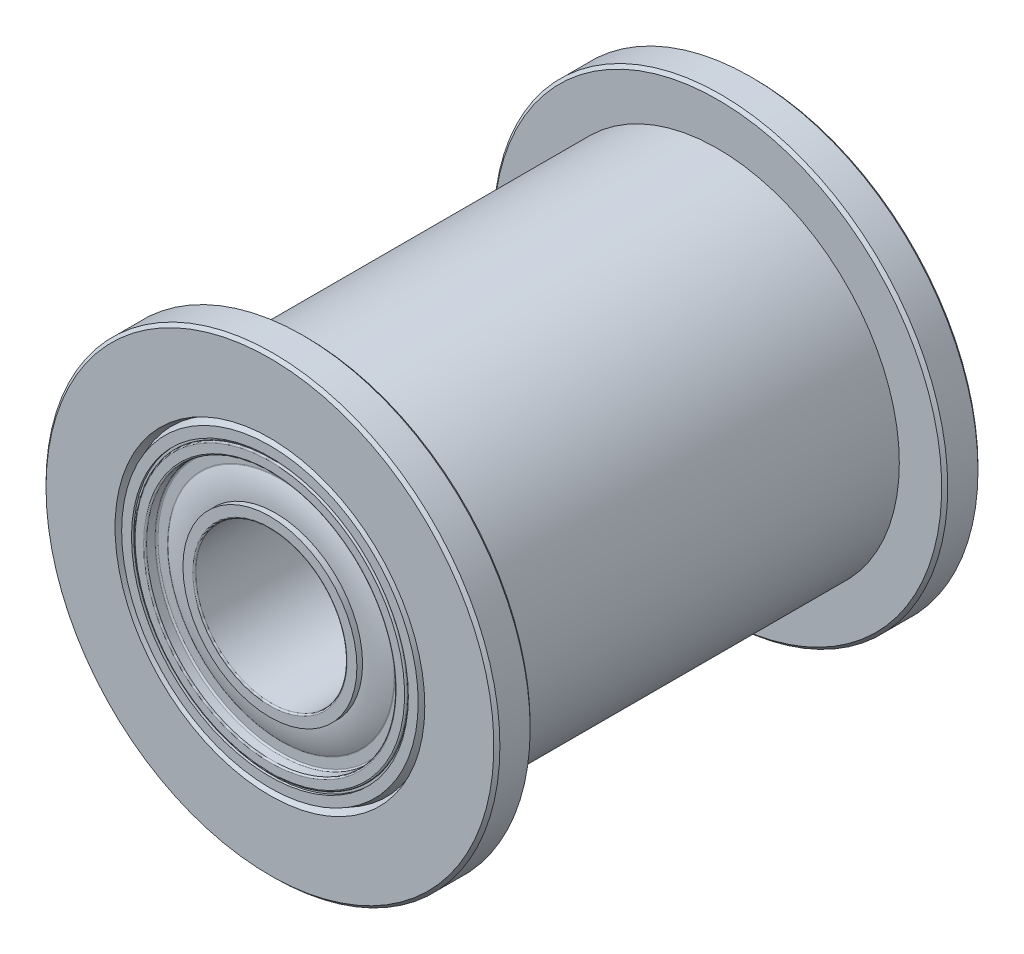
ISO-10303-21;
HEADER;
FILE_DESCRIPTION(('STEP AP214'),'2;1');
FILE_NAME('part.step','',(''),(''),'','','');
FILE_SCHEMA(('AUTOMOTIVE_DESIGN { 1 0 10303 214 1 1 1 1 }'));
ENDSEC;
DATA;
#1=APPLICATION_CONTEXT('core data for automotive mechanical design processes');
#2=APPLICATION_PROTOCOL_DEFINITION('international standard','automotive_design',2000,#1);
#3=PRODUCT_CONTEXT('',#1,'mechanical');
#4=PRODUCT('Part','Part','',(#3));
#5=PRODUCT_RELATED_PRODUCT_CATEGORY('part','',(#4));
#6=PRODUCT_DEFINITION_FORMATION('','',#4);
#7=PRODUCT_DEFINITION_CONTEXT('part definition',#1,'design');
#8=PRODUCT_DEFINITION('design','',#6,#7);
#9=PRODUCT_DEFINITION_SHAPE('','',#8);
#10=(LENGTH_UNIT() NAMED_UNIT(*) SI_UNIT(.MILLI.,.METRE.));
#11=(NAMED_UNIT(*) PLANE_ANGLE_UNIT() SI_UNIT($,.RADIAN.));
#12=(NAMED_UNIT(*) SI_UNIT($,.STERADIAN.) SOLID_ANGLE_UNIT());
#13=UNCERTAINTY_MEASURE_WITH_UNIT(LENGTH_MEASURE(1.E-05),#10,'distance_accuracy_value','');
#14=(GEOMETRIC_REPRESENTATION_CONTEXT(3) GLOBAL_UNCERTAINTY_ASSIGNED_CONTEXT((#13)) GLOBAL_UNIT_ASSIGNED_CONTEXT((#10,
#11,#12)) REPRESENTATION_CONTEXT('',''));
#15=CARTESIAN_POINT('',(0.,0.,0.));
#16=DIRECTION('',(0.,0.,1.));
#17=DIRECTION('',(1.,0.,0.));
#18=AXIS2_PLACEMENT_3D('',#15,#16,#17);
#19=CARTESIAN_POINT('',(0.,7.5,-6.8));
#20=DIRECTION('',(0.,0.,-1.));
#21=DIRECTION('',(-1.,0.,0.));
#22=AXIS2_PLACEMENT_3D('',#19,#20,#21);
#23=PLANE('',#22);
#24=CARTESIAN_POINT('',(0.,0.,-6.8));
#25=DIRECTION('',(0.,0.,-1.));
#26=DIRECTION('',(-1.,0.,0.));
#27=AXIS2_PLACEMENT_3D('',#24,#25,#26);
#28=CIRCLE('',#27,7.39999999999999);
#29=CARTESIAN_POINT('',(-7.39999999999999,0.,-6.8));
#30=VERTEX_POINT('',#29);
#31=EDGE_CURVE('E54',#30,#30,#28,.F.);
#32=ORIENTED_EDGE('',*,*,#31,.T.);
#33=EDGE_LOOP('',(#32));
#34=FACE_BOUND('',#33,.T.);
#35=CARTESIAN_POINT('',(0.,0.,-6.8));
#36=DIRECTION('',(0.,0.,1.));
#37=DIRECTION('',(1.,0.,0.));
#38=AXIS2_PLACEMENT_3D('',#35,#36,#37);
#39=CIRCLE('',#38,6.);
#40=CARTESIAN_POINT('',(6.,0.,-6.8));
#41=VERTEX_POINT('',#40);
#42=EDGE_CURVE('E85',#41,#41,#39,.T.);
#43=ORIENTED_EDGE('',*,*,#42,.F.);
#44=EDGE_LOOP('',(#43));
#45=FACE_BOUND('',#44,.T.);
#46=ADVANCED_FACE('F34',(#34,#45),#23,.F.);
#47=CARTESIAN_POINT('',(0.,0.,8.));
#48=DIRECTION('',(0.,0.,1.));
#49=DIRECTION('',(1.,0.,0.));
#50=AXIS2_PLACEMENT_3D('',#47,#48,#49);
#51=CYLINDRICAL_SURFACE('',#50,7.5);
#52=CARTESIAN_POINT('',(0.,0.,-7.9));
#53=DIRECTION('',(0.,0.,1.));
#54=DIRECTION('',(1.,0.,0.));
#55=AXIS2_PLACEMENT_3D('',#52,#53,#54);
#56=CIRCLE('',#55,7.5);
#57=CARTESIAN_POINT('',(7.5,0.,-7.9));
#58=VERTEX_POINT('',#57);
#59=EDGE_CURVE('E60',#58,#58,#56,.T.);
#60=ORIENTED_EDGE('',*,*,#59,.T.);
#61=EDGE_LOOP('',(#60));
#62=FACE_BOUND('',#61,.T.);
#63=CARTESIAN_POINT('',(0.,0.,-6.90000000000001));
#64=DIRECTION('',(0.,0.,-1.));
#65=DIRECTION('',(-1.,0.,0.));
#66=AXIS2_PLACEMENT_3D('',#63,#64,#65);
#67=CIRCLE('',#66,7.5);
#68=CARTESIAN_POINT('',(-7.5,0.,-6.90000000000001));
#69=VERTEX_POINT('',#68);
#70=EDGE_CURVE('E63',#69,#69,#67,.T.);
#71=ORIENTED_EDGE('',*,*,#70,.T.);
#72=EDGE_LOOP('',(#71));
#73=FACE_BOUND('',#72,.T.);
#74=ADVANCED_FACE('F200',(#62,#73),#51,.T.);
#75=CARTESIAN_POINT('',(0.,7.5,-8.));
#76=DIRECTION('',(0.,0.,1.));
#77=DIRECTION('',(1.,0.,0.));
#78=AXIS2_PLACEMENT_3D('',#75,#76,#77);
#79=PLANE('',#78);
#80=CARTESIAN_POINT('',(0.,0.,-8.));
#81=DIRECTION('',(0.,0.,1.));
#82=DIRECTION('',(1.,0.,0.));
#83=AXIS2_PLACEMENT_3D('',#80,#81,#82);
#84=CIRCLE('',#83,7.40000000000001);
#85=CARTESIAN_POINT('',(7.40000000000001,0.,-8.));
#86=VERTEX_POINT('',#85);
#87=EDGE_CURVE('E57',#86,#86,#84,.F.);
#88=ORIENTED_EDGE('',*,*,#87,.T.);
#89=EDGE_LOOP('',(#88));
#90=FACE_BOUND('',#89,.T.);
#91=CARTESIAN_POINT('',(0.,0.,-8.));
#92=DIRECTION('',(0.,0.,1.));
#93=DIRECTION('',(1.,0.,0.));
#94=AXIS2_PLACEMENT_3D('',#91,#92,#93);
#95=CIRCLE('',#94,5.11838214055972);
#96=CARTESIAN_POINT('',(5.11838214055972,0.,-8.));
#97=VERTEX_POINT('',#96);
#98=EDGE_CURVE('E66',#97,#97,#95,.T.);
#99=ORIENTED_EDGE('',*,*,#98,.T.);
#100=EDGE_LOOP('',(#99));
#101=FACE_BOUND('',#100,.T.);
#102=ADVANCED_FACE('F206',(#90,#101),#79,.F.);
#103=CARTESIAN_POINT('',(0.,0.,-7.7));
#104=DIRECTION('',(0.,0.,-1.));
#105=DIRECTION('',(-1.,0.,0.));
#106=AXIS2_PLACEMENT_3D('',#103,#104,#105);
#107=CONICAL_SURFACE('',#106,5.00919107027986,0.349065850398862);
#108=ORIENTED_EDGE('',*,*,#98,.F.);
#109=EDGE_LOOP('',(#108));
#110=FACE_BOUND('',#109,.T.);
#111=CARTESIAN_POINT('',(0.,0.,-7.7));
#112=DIRECTION('',(0.,0.,1.));
#113=DIRECTION('',(1.,0.,0.));
#114=AXIS2_PLACEMENT_3D('',#111,#112,#113);
#115=CIRCLE('',#114,5.00919107027986);
#116=CARTESIAN_POINT('',(5.00919107027986,0.,-7.7));
#117=VERTEX_POINT('',#116);
#118=EDGE_CURVE('E69',#117,#117,#115,.T.);
#119=ORIENTED_EDGE('',*,*,#118,.T.);
#120=EDGE_LOOP('',(#119));
#121=FACE_BOUND('',#120,.T.);
#122=ADVANCED_FACE('F282',(#110,#121),#107,.F.);
#123=CARTESIAN_POINT('',(0.,0.,-8.));
#124=DIRECTION('',(0.,0.,1.));
#125=DIRECTION('',(1.,0.,0.));
#126=AXIS2_PLACEMENT_3D('',#123,#124,#125);
#127=CONICAL_SURFACE('',#126,4.9,0.349065850398862);
#128=ORIENTED_EDGE('',*,*,#118,.F.);
#129=EDGE_LOOP('',(#128));
#130=FACE_BOUND('',#129,.T.);
#131=CARTESIAN_POINT('',(0.,0.,-8.));
#132=DIRECTION('',(0.,0.,1.));
#133=DIRECTION('',(1.,0.,0.));
#134=AXIS2_PLACEMENT_3D('',#131,#132,#133);
#135=CIRCLE('',#134,4.9);
#136=CARTESIAN_POINT('',(4.9,0.,-8.));
#137=VERTEX_POINT('',#136);
#138=EDGE_CURVE('E72',#137,#137,#135,.T.);
#139=ORIENTED_EDGE('',*,*,#138,.T.);
#140=EDGE_LOOP('',(#139));
#141=FACE_BOUND('',#140,.T.);
#142=ADVANCED_FACE('F278',(#130,#141),#127,.T.);
#143=CARTESIAN_POINT('',(0.,4.9,-8.));
#144=DIRECTION('',(0.,0.,1.));
#145=DIRECTION('',(1.,0.,0.));
#146=AXIS2_PLACEMENT_3D('',#143,#144,#145);
#147=PLANE('',#146);
#148=ORIENTED_EDGE('',*,*,#138,.F.);
#149=EDGE_LOOP('',(#148));
#150=FACE_BOUND('',#149,.T.);
#151=CARTESIAN_POINT('',(0.,0.,-8.));
#152=DIRECTION('',(0.,0.,1.));
#153=DIRECTION('',(1.,0.,0.));
#154=AXIS2_PLACEMENT_3D('',#151,#152,#153);
#155=CIRCLE('',#154,4.575);
#156=CARTESIAN_POINT('',(4.575,0.,-8.));
#157=VERTEX_POINT('',#156);
#158=EDGE_CURVE('E75',#157,#157,#155,.T.);
#159=ORIENTED_EDGE('',*,*,#158,.T.);
#160=EDGE_LOOP('',(#159));
#161=FACE_BOUND('',#160,.T.);
#162=ADVANCED_FACE('F274',(#150,#161),#147,.F.);
#163=CARTESIAN_POINT('',(0.,0.,8.));
#164=DIRECTION('',(0.,0.,1.));
#165=DIRECTION('',(1.,0.,0.));
#166=AXIS2_PLACEMENT_3D('',#163,#164,#165);
#167=CYLINDRICAL_SURFACE('',#166,4.575);
#168=ORIENTED_EDGE('',*,*,#158,.F.);
#169=EDGE_LOOP('',(#168));
#170=FACE_BOUND('',#169,.T.);
#171=CARTESIAN_POINT('',(0.,0.,-7.925));
#172=DIRECTION('',(0.,0.,1.));
#173=DIRECTION('',(1.,0.,0.));
#174=AXIS2_PLACEMENT_3D('',#171,#172,#173);
#175=CIRCLE('',#174,4.575);
#176=CARTESIAN_POINT('',(4.575,0.,-7.925));
#177=VERTEX_POINT('',#176);
#178=EDGE_CURVE('E78',#177,#177,#175,.T.);
#179=ORIENTED_EDGE('',*,*,#178,.T.);
#180=EDGE_LOOP('',(#179));
#181=FACE_BOUND('',#180,.T.);
#182=ADVANCED_FACE('F270',(#170,#181),#167,.F.);
#183=CARTESIAN_POINT('',(0.,4.5,-7.925));
#184=DIRECTION('',(0.,0.,1.));
#185=DIRECTION('',(1.,0.,0.));
#186=AXIS2_PLACEMENT_3D('',#183,#184,#185);
#187=PLANE('',#186);
#188=ORIENTED_EDGE('',*,*,#178,.F.);
#189=EDGE_LOOP('',(#188));
#190=FACE_BOUND('',#189,.T.);
#191=CARTESIAN_POINT('',(0.,0.,-7.925));
#192=DIRECTION('',(0.,0.,1.));
#193=DIRECTION('',(1.,0.,0.));
#194=AXIS2_PLACEMENT_3D('',#191,#192,#193);
#195=CIRCLE('',#194,4.5);
#196=CARTESIAN_POINT('',(4.5,0.,-7.925));
#197=VERTEX_POINT('',#196);
#198=EDGE_CURVE('E82',#197,#197,#195,.T.);
#199=ORIENTED_EDGE('',*,*,#198,.T.);
#200=EDGE_LOOP('',(#199));
#201=FACE_BOUND('',#200,.T.);
#202=ADVANCED_FACE('F266',(#190,#201),#187,.F.);
#203=CARTESIAN_POINT('',(0.,4.5,7.925));
#204=DIRECTION('',(0.,0.,-1.));
#205=DIRECTION('',(-1.,0.,0.));
#206=AXIS2_PLACEMENT_3D('',#203,#204,#205);
#207=PLANE('',#206);
#208=CARTESIAN_POINT('',(0.,0.,7.925));
#209=DIRECTION('',(0.,0.,1.));
#210=DIRECTION('',(1.,0.,0.));
#211=AXIS2_PLACEMENT_3D('',#208,#209,#210);
#212=CIRCLE('',#211,4.5);
#213=CARTESIAN_POINT('',(4.5,0.,7.925));
#214=VERTEX_POINT('',#213);
#215=EDGE_CURVE('E81',#214,#214,#212,.T.);
#216=ORIENTED_EDGE('',*,*,#215,.F.);
#217=EDGE_LOOP('',(#216));
#218=FACE_BOUND('',#217,.T.);
#219=CARTESIAN_POINT('',(0.,0.,7.925));
#220=DIRECTION('',(0.,0.,1.));
#221=DIRECTION('',(1.,0.,0.));
#222=AXIS2_PLACEMENT_3D('',#219,#220,#221);
#223=CIRCLE('',#222,4.575);
#224=CARTESIAN_POINT('',(4.575,0.,7.925));
#225=VERTEX_POINT('',#224);
#226=EDGE_CURVE('E89',#225,#225,#223,.T.);
#227=ORIENTED_EDGE('',*,*,#226,.T.);
#228=EDGE_LOOP('',(#227));
#229=FACE_BOUND('',#228,.T.);
#230=ADVANCED_FACE('F262',(#218,#229),#207,.F.);
#231=CARTESIAN_POINT('',(0.,0.,8.));
#232=DIRECTION('',(0.,0.,1.));
#233=DIRECTION('',(1.,0.,0.));
#234=AXIS2_PLACEMENT_3D('',#231,#232,#233);
#235=CYLINDRICAL_SURFACE('',#234,4.575);
#236=ORIENTED_EDGE('',*,*,#226,.F.);
#237=EDGE_LOOP('',(#236));
#238=FACE_BOUND('',#237,.T.);
#239=CARTESIAN_POINT('',(0.,0.,8.));
#240=DIRECTION('',(0.,0.,1.));
#241=DIRECTION('',(1.,0.,0.));
#242=AXIS2_PLACEMENT_3D('',#239,#240,#241);
#243=CIRCLE('',#242,4.575);
#244=CARTESIAN_POINT('',(4.575,0.,8.));
#245=VERTEX_POINT('',#244);
#246=EDGE_CURVE('E92',#245,#245,#243,.T.);
#247=ORIENTED_EDGE('',*,*,#246,.T.);
#248=EDGE_LOOP('',(#247));
#249=FACE_BOUND('',#248,.T.);
#250=ADVANCED_FACE('F258',(#238,#249),#235,.F.);
#251=CARTESIAN_POINT('',(0.,4.9,8.));
#252=DIRECTION('',(0.,0.,-1.));
#253=DIRECTION('',(-1.,0.,0.));
#254=AXIS2_PLACEMENT_3D('',#251,#252,#253);
#255=PLANE('',#254);
#256=ORIENTED_EDGE('',*,*,#246,.F.);
#257=EDGE_LOOP('',(#256));
#258=FACE_BOUND('',#257,.T.);
#259=CARTESIAN_POINT('',(0.,0.,8.));
#260=DIRECTION('',(0.,0.,1.));
#261=DIRECTION('',(1.,0.,0.));
#262=AXIS2_PLACEMENT_3D('',#259,#260,#261);
#263=CIRCLE('',#262,4.9);
#264=CARTESIAN_POINT('',(4.9,0.,8.));
#265=VERTEX_POINT('',#264);
#266=EDGE_CURVE('E95',#265,#265,#263,.T.);
#267=ORIENTED_EDGE('',*,*,#266,.T.);
#268=EDGE_LOOP('',(#267));
#269=FACE_BOUND('',#268,.T.);
#270=ADVANCED_FACE('F254',(#258,#269),#255,.F.);
#271=CARTESIAN_POINT('',(0.,0.,7.7));
#272=DIRECTION('',(0.,0.,-1.));
#273=DIRECTION('',(-1.,0.,0.));
#274=AXIS2_PLACEMENT_3D('',#271,#272,#273);
#275=CONICAL_SURFACE('',#274,5.00919107027986,0.349065850398864);
#276=ORIENTED_EDGE('',*,*,#266,.F.);
#277=EDGE_LOOP('',(#276));
#278=FACE_BOUND('',#277,.T.);
#279=CARTESIAN_POINT('',(0.,0.,7.7));
#280=DIRECTION('',(0.,0.,1.));
#281=DIRECTION('',(1.,0.,0.));
#282=AXIS2_PLACEMENT_3D('',#279,#280,#281);
#283=CIRCLE('',#282,5.00919107027986);
#284=CARTESIAN_POINT('',(5.00919107027986,0.,7.7));
#285=VERTEX_POINT('',#284);
#286=EDGE_CURVE('E98',#285,#285,#283,.T.);
#287=ORIENTED_EDGE('',*,*,#286,.T.);
#288=EDGE_LOOP('',(#287));
#289=FACE_BOUND('',#288,.T.);
#290=ADVANCED_FACE('F250',(#278,#289),#275,.T.);
#291=CARTESIAN_POINT('',(0.,0.,8.));
#292=DIRECTION('',(0.,0.,1.));
#293=DIRECTION('',(1.,0.,0.));
#294=AXIS2_PLACEMENT_3D('',#291,#292,#293);
#295=CONICAL_SURFACE('',#294,5.11838214055972,0.349065850398864);
#296=ORIENTED_EDGE('',*,*,#286,.F.);
#297=EDGE_LOOP('',(#296));
#298=FACE_BOUND('',#297,.T.);
#299=CARTESIAN_POINT('',(0.,0.,8.));
#300=DIRECTION('',(0.,0.,1.));
#301=DIRECTION('',(1.,0.,0.));
#302=AXIS2_PLACEMENT_3D('',#299,#300,#301);
#303=CIRCLE('',#302,5.11838214055972);
#304=CARTESIAN_POINT('',(5.11838214055972,0.,8.));
#305=VERTEX_POINT('',#304);
#306=EDGE_CURVE('E101',#305,#305,#303,.T.);
#307=ORIENTED_EDGE('',*,*,#306,.T.);
#308=EDGE_LOOP('',(#307));
#309=FACE_BOUND('',#308,.T.);
#310=ADVANCED_FACE('F244',(#298,#309),#295,.F.);
#311=CARTESIAN_POINT('',(0.,7.5,8.));
#312=DIRECTION('',(0.,0.,-1.));
#313=DIRECTION('',(-1.,0.,0.));
#314=AXIS2_PLACEMENT_3D('',#311,#312,#313);
#315=PLANE('',#314);
#316=CARTESIAN_POINT('',(0.,0.,8.));
#317=DIRECTION('',(0.,0.,-1.));
#318=DIRECTION('',(-1.,0.,0.));
#319=AXIS2_PLACEMENT_3D('',#316,#317,#318);
#320=CIRCLE('',#319,7.4);
#321=CARTESIAN_POINT('',(-7.4,0.,8.));
#322=VERTEX_POINT('',#321);
#323=EDGE_CURVE('E10',#322,#322,#320,.F.);
#324=ORIENTED_EDGE('',*,*,#323,.T.);
#325=EDGE_LOOP('',(#324));
#326=FACE_BOUND('',#325,.T.);
#327=ORIENTED_EDGE('',*,*,#306,.F.);
#328=EDGE_LOOP('',(#327));
#329=FACE_BOUND('',#328,.T.);
#330=ADVANCED_FACE('F235',(#326,#329),#315,.F.);
#331=CARTESIAN_POINT('',(0.,0.,8.));
#332=DIRECTION('',(0.,0.,1.));
#333=DIRECTION('',(1.,0.,0.));
#334=AXIS2_PLACEMENT_3D('',#331,#332,#333);
#335=CYLINDRICAL_SURFACE('',#334,7.5);
#336=CARTESIAN_POINT('',(0.,0.,6.9));
#337=DIRECTION('',(0.,0.,1.));
#338=DIRECTION('',(1.,0.,0.));
#339=AXIS2_PLACEMENT_3D('',#336,#337,#338);
#340=CIRCLE('',#339,7.5);
#341=CARTESIAN_POINT('',(7.5,0.,6.9));
#342=VERTEX_POINT('',#341);
#343=EDGE_CURVE('E45',#342,#342,#340,.T.);
#344=ORIENTED_EDGE('',*,*,#343,.T.);
#345=EDGE_LOOP('',(#344));
#346=FACE_BOUND('',#345,.T.);
#347=CARTESIAN_POINT('',(0.,0.,7.9));
#348=DIRECTION('',(0.,0.,-1.));
#349=DIRECTION('',(-1.,0.,0.));
#350=AXIS2_PLACEMENT_3D('',#347,#348,#349);
#351=CIRCLE('',#350,7.5);
#352=CARTESIAN_POINT('',(-7.5,0.,7.9));
#353=VERTEX_POINT('',#352);
#354=EDGE_CURVE('E49',#353,#353,#351,.T.);
#355=ORIENTED_EDGE('',*,*,#354,.T.);
#356=EDGE_LOOP('',(#355));
#357=FACE_BOUND('',#356,.T.);
#358=ADVANCED_FACE('F231',(#346,#357),#335,.T.);
#359=CARTESIAN_POINT('',(0.,7.5,6.8));
#360=DIRECTION('',(0.,0.,1.));
#361=DIRECTION('',(1.,0.,0.));
#362=AXIS2_PLACEMENT_3D('',#359,#360,#361);
#363=PLANE('',#362);
#364=CARTESIAN_POINT('',(0.,0.,6.8));
#365=DIRECTION('',(0.,0.,1.));
#366=DIRECTION('',(1.,0.,0.));
#367=AXIS2_PLACEMENT_3D('',#364,#365,#366);
#368=CIRCLE('',#367,7.4);
#369=CARTESIAN_POINT('',(7.4,0.,6.8));
#370=VERTEX_POINT('',#369);
#371=EDGE_CURVE('E41',#370,#370,#368,.F.);
#372=ORIENTED_EDGE('',*,*,#371,.T.);
#373=EDGE_LOOP('',(#372));
#374=FACE_BOUND('',#373,.T.);
#375=CARTESIAN_POINT('',(0.,0.,6.8));
#376=DIRECTION('',(0.,0.,1.));
#377=DIRECTION('',(1.,0.,0.));
#378=AXIS2_PLACEMENT_3D('',#375,#376,#377);
#379=CIRCLE('',#378,6.);
#380=CARTESIAN_POINT('',(6.,0.,6.8));
#381=VERTEX_POINT('',#380);
#382=EDGE_CURVE('E104',#381,#381,#379,.T.);
#383=ORIENTED_EDGE('',*,*,#382,.T.);
#384=EDGE_LOOP('',(#383));
#385=FACE_BOUND('',#384,.T.);
#386=ADVANCED_FACE('F234',(#374,#385),#363,.F.);
#387=CARTESIAN_POINT('',(0.,0.,8.));
#388=DIRECTION('',(0.,0.,1.));
#389=DIRECTION('',(1.,0.,0.));
#390=AXIS2_PLACEMENT_3D('',#387,#388,#389);
#391=CYLINDRICAL_SURFACE('',#390,6.);
#392=ORIENTED_EDGE('',*,*,#382,.F.);
#393=EDGE_LOOP('',(#392));
#394=FACE_BOUND('',#393,.T.);
#395=ORIENTED_EDGE('',*,*,#42,.T.);
#396=EDGE_LOOP('',(#395));
#397=FACE_BOUND('',#396,.T.);
#398=ADVANCED_FACE('F216',(#394,#397),#391,.T.);
#399=CARTESIAN_POINT('',(0.,0.,-7.9));
#400=DIRECTION('',(0.,0.,1.));
#401=DIRECTION('',(1.,0.,0.));
#402=AXIS2_PLACEMENT_3D('',#399,#400,#401);
#403=CONICAL_SURFACE('',#402,7.5,0.785398163397448);
#404=ORIENTED_EDGE('',*,*,#87,.F.);
#405=EDGE_LOOP('',(#404));
#406=FACE_BOUND('',#405,.T.);
#407=ORIENTED_EDGE('',*,*,#59,.F.);
#408=EDGE_LOOP('',(#407));
#409=FACE_BOUND('',#408,.T.);
#410=ADVANCED_FACE('F212',(#406,#409),#403,.T.);
#411=CARTESIAN_POINT('',(0.,0.,-6.8));
#412=DIRECTION('',(0.,0.,-1.));
#413=DIRECTION('',(-1.,0.,0.));
#414=AXIS2_PLACEMENT_3D('',#411,#412,#413);
#415=CONICAL_SURFACE('',#414,7.39999999999999,0.785398163397448);
#416=ORIENTED_EDGE('',*,*,#70,.F.);
#417=EDGE_LOOP('',(#416));
#418=FACE_BOUND('',#417,.T.);
#419=ORIENTED_EDGE('',*,*,#31,.F.);
#420=EDGE_LOOP('',(#419));
#421=FACE_BOUND('',#420,.T.);
#422=ADVANCED_FACE('F215',(#418,#421),#415,.T.);
#423=CARTESIAN_POINT('',(0.,0.,6.9));
#424=DIRECTION('',(0.,0.,1.));
#425=DIRECTION('',(1.,0.,0.));
#426=AXIS2_PLACEMENT_3D('',#423,#424,#425);
#427=CONICAL_SURFACE('',#426,7.5,0.785398163397448);
#428=ORIENTED_EDGE('',*,*,#371,.F.);
#429=EDGE_LOOP('',(#428));
#430=FACE_BOUND('',#429,.T.);
#431=ORIENTED_EDGE('',*,*,#343,.F.);
#432=EDGE_LOOP('',(#431));
#433=FACE_BOUND('',#432,.T.);
#434=ADVANCED_FACE('F219',(#430,#433),#427,.T.);
#435=CARTESIAN_POINT('',(0.,0.,8.));
#436=DIRECTION('',(0.,0.,-1.));
#437=DIRECTION('',(-1.,0.,0.));
#438=AXIS2_PLACEMENT_3D('',#435,#436,#437);
#439=CONICAL_SURFACE('',#438,7.4,0.785398163397461);
#440=ORIENTED_EDGE('',*,*,#354,.F.);
#441=EDGE_LOOP('',(#440));
#442=FACE_BOUND('',#441,.T.);
#443=ORIENTED_EDGE('',*,*,#323,.F.);
#444=EDGE_LOOP('',(#443));
#445=FACE_BOUND('',#444,.T.);
#446=ADVANCED_FACE('F36',(#442,#445),#439,.T.);
#447=CARTESIAN_POINT('',(0.,0.,8.));
#448=DIRECTION('',(0.,0.,1.));
#449=DIRECTION('',(1.,0.,0.));
#450=AXIS2_PLACEMENT_3D('',#447,#448,#449);
#451=CYLINDRICAL_SURFACE('',#450,4.5);
#452=CARTESIAN_POINT('',(0.,0.,7.95));
#453=DIRECTION('',(0.,0.,-1.));
#454=DIRECTION('',(-1.,0.,0.));
#455=AXIS2_PLACEMENT_3D('',#452,#453,#454);
#456=CIRCLE('',#455,4.5);
#457=CARTESIAN_POINT('',(-4.5,0.,7.95));
#458=VERTEX_POINT('',#457);
#459=EDGE_CURVE('E150',#458,#458,#456,.T.);
#460=ORIENTED_EDGE('',*,*,#459,.T.);
#461=EDGE_LOOP('',(#460));
#462=FACE_BOUND('',#461,.T.);
#463=ORIENTED_EDGE('',*,*,#215,.T.);
#464=EDGE_LOOP('',(#463));
#465=FACE_BOUND('',#464,.T.);
#466=ADVANCED_FACE('F226',(#462,#465),#451,.T.);
#467=CARTESIAN_POINT('',(0.,2.5,-8.));
#468=DIRECTION('',(0.,0.,1.));
#469=DIRECTION('',(1.,0.,0.));
#470=AXIS2_PLACEMENT_3D('',#467,#468,#469);
#471=PLANE('',#470);
#472=CARTESIAN_POINT('',(0.,0.,-8.));
#473=DIRECTION('',(0.,0.,1.));
#474=DIRECTION('',(1.,0.,0.));
#475=AXIS2_PLACEMENT_3D('',#472,#473,#474);
#476=CIRCLE('',#475,2.55);
#477=CARTESIAN_POINT('',(2.55,0.,-8.));
#478=VERTEX_POINT('',#477);
#479=EDGE_CURVE('E162',#478,#478,#476,.T.);
#480=ORIENTED_EDGE('',*,*,#479,.T.);
#481=EDGE_LOOP('',(#480));
#482=FACE_BOUND('',#481,.T.);
#483=CARTESIAN_POINT('',(0.,0.,-8.));
#484=DIRECTION('',(0.,0.,1.));
#485=DIRECTION('',(1.,0.,0.));
#486=AXIS2_PLACEMENT_3D('',#483,#484,#485);
#487=CIRCLE('',#486,2.825);
#488=CARTESIAN_POINT('',(2.825,0.,-8.));
#489=VERTEX_POINT('',#488);
#490=EDGE_CURVE('E165',#489,#489,#487,.F.);
#491=ORIENTED_EDGE('',*,*,#490,.T.);
#492=EDGE_LOOP('',(#491));
#493=FACE_BOUND('',#492,.T.);
#494=ADVANCED_FACE('F470',(#482,#493),#471,.F.);
#495=CARTESIAN_POINT('',(0.,0.,8.));
#496=DIRECTION('',(0.,0.,1.));
#497=DIRECTION('',(1.,0.,0.));
#498=AXIS2_PLACEMENT_3D('',#495,#496,#497);
#499=CYLINDRICAL_SURFACE('',#498,2.5);
#500=CARTESIAN_POINT('',(0.,0.,-7.95));
#501=DIRECTION('',(0.,0.,1.));
#502=DIRECTION('',(1.,0.,0.));
#503=AXIS2_PLACEMENT_3D('',#500,#501,#502);
#504=CIRCLE('',#503,2.5);
#505=CARTESIAN_POINT('',(2.5,0.,-7.95));
#506=VERTEX_POINT('',#505);
#507=EDGE_CURVE('E156',#506,#506,#504,.F.);
#508=ORIENTED_EDGE('',*,*,#507,.T.);
#509=EDGE_LOOP('',(#508));
#510=FACE_BOUND('',#509,.T.);
#511=CARTESIAN_POINT('',(0.,0.,7.95));
#512=DIRECTION('',(0.,0.,-1.));
#513=DIRECTION('',(-1.,0.,0.));
#514=AXIS2_PLACEMENT_3D('',#511,#512,#513);
#515=CIRCLE('',#514,2.5);
#516=CARTESIAN_POINT('',(-2.5,0.,7.95));
#517=VERTEX_POINT('',#516);
#518=EDGE_CURVE('E159',#517,#517,#515,.F.);
#519=ORIENTED_EDGE('',*,*,#518,.T.);
#520=EDGE_LOOP('',(#519));
#521=FACE_BOUND('',#520,.T.);
#522=ADVANCED_FACE('F308',(#510,#521),#499,.F.);
#523=ORIENTED_EDGE('',*,*,#198,.F.);
#524=EDGE_LOOP('',(#523));
#525=FACE_BOUND('',#524,.T.);
#526=CARTESIAN_POINT('',(0.,0.,-7.95));
#527=DIRECTION('',(0.,0.,1.));
#528=DIRECTION('',(1.,0.,0.));
#529=AXIS2_PLACEMENT_3D('',#526,#527,#528);
#530=CIRCLE('',#529,4.5);
#531=CARTESIAN_POINT('',(4.5,0.,-7.95));
#532=VERTEX_POINT('',#531);
#533=EDGE_CURVE('E147',#532,#532,#530,.T.);
#534=ORIENTED_EDGE('',*,*,#533,.T.);
#535=EDGE_LOOP('',(#534));
#536=FACE_BOUND('',#535,.T.);
#537=ADVANCED_FACE('F304',(#525,#536),#451,.T.);
#538=CARTESIAN_POINT('',(0.,4.5,-8.));
#539=DIRECTION('',(0.,0.,1.));
#540=DIRECTION('',(1.,0.,0.));
#541=AXIS2_PLACEMENT_3D('',#538,#539,#540);
#542=PLANE('',#541);
#543=CARTESIAN_POINT('',(0.,0.,-8.));
#544=DIRECTION('',(0.,0.,1.));
#545=DIRECTION('',(1.,0.,0.));
#546=AXIS2_PLACEMENT_3D('',#543,#544,#545);
#547=CIRCLE('',#546,4.45);
#548=CARTESIAN_POINT('',(4.45,0.,-8.));
#549=VERTEX_POINT('',#548);
#550=EDGE_CURVE('E141',#549,#549,#547,.F.);
#551=ORIENTED_EDGE('',*,*,#550,.T.);
#552=EDGE_LOOP('',(#551));
#553=FACE_BOUND('',#552,.T.);
#554=CARTESIAN_POINT('',(0.,0.,-8.));
#555=DIRECTION('',(0.,0.,1.));
#556=DIRECTION('',(1.,0.,0.));
#557=AXIS2_PLACEMENT_3D('',#554,#555,#556);
#558=CIRCLE('',#557,4.175);
#559=CARTESIAN_POINT('',(4.175,0.,-8.));
#560=VERTEX_POINT('',#559);
#561=EDGE_CURVE('E144',#560,#560,#558,.T.);
#562=ORIENTED_EDGE('',*,*,#561,.T.);
#563=EDGE_LOOP('',(#562));
#564=FACE_BOUND('',#563,.T.);
#565=ADVANCED_FACE('F307',(#553,#564),#542,.F.);
#566=CARTESIAN_POINT('',(0.,0.,8.));
#567=DIRECTION('',(0.,0.,1.));
#568=DIRECTION('',(1.,0.,0.));
#569=AXIS2_PLACEMENT_3D('',#566,#567,#568);
#570=CYLINDRICAL_SURFACE('',#569,4.125);
#571=CARTESIAN_POINT('',(0.,0.,-7.95));
#572=DIRECTION('',(0.,0.,1.));
#573=DIRECTION('',(1.,0.,0.));
#574=AXIS2_PLACEMENT_3D('',#571,#572,#573);
#575=CIRCLE('',#574,4.125);
#576=CARTESIAN_POINT('',(4.125,0.,-7.95));
#577=VERTEX_POINT('',#576);
#578=EDGE_CURVE('E132',#577,#577,#575,.F.);
#579=ORIENTED_EDGE('',*,*,#578,.T.);
#580=EDGE_LOOP('',(#579));
#581=FACE_BOUND('',#580,.T.);
#582=CARTESIAN_POINT('',(0.,0.,-7.625));
#583=DIRECTION('',(0.,0.,1.));
#584=DIRECTION('',(1.,0.,0.));
#585=AXIS2_PLACEMENT_3D('',#582,#583,#584);
#586=CIRCLE('',#585,4.125);
#587=CARTESIAN_POINT('',(4.125,0.,-7.625));
#588=VERTEX_POINT('',#587);
#589=EDGE_CURVE('E168',#588,#588,#586,.T.);
#590=ORIENTED_EDGE('',*,*,#589,.T.);
#591=EDGE_LOOP('',(#590));
#592=FACE_BOUND('',#591,.T.);
#593=ADVANCED_FACE('F506',(#581,#592),#570,.F.);
#594=CARTESIAN_POINT('',(0.,3.75,-7.625));
#595=DIRECTION('',(0.,0.,1.));
#596=DIRECTION('',(1.,0.,0.));
#597=AXIS2_PLACEMENT_3D('',#594,#595,#596);
#598=PLANE('',#597);
#599=CARTESIAN_POINT('',(0.,0.,-7.625));
#600=DIRECTION('',(0.,0.,1.));
#601=DIRECTION('',(1.,0.,0.));
#602=AXIS2_PLACEMENT_3D('',#599,#600,#601);
#603=CIRCLE('',#602,3.76064947919592);
#604=CARTESIAN_POINT('',(3.76064947919592,0.,-7.625));
#605=VERTEX_POINT('',#604);
#606=EDGE_CURVE('E138',#605,#605,#603,.T.);
#607=ORIENTED_EDGE('',*,*,#606,.T.);
#608=EDGE_LOOP('',(#607));
#609=FACE_BOUND('',#608,.T.);
#610=ORIENTED_EDGE('',*,*,#589,.F.);
#611=EDGE_LOOP('',(#610));
#612=FACE_BOUND('',#611,.T.);
#613=ADVANCED_FACE('F516',(#609,#612),#598,.F.);
#614=CARTESIAN_POINT('',(0.,0.,-5.67708333333334));
#615=DIRECTION('',(0.,0.,1.));
#616=DIRECTION('',(1.,0.,0.));
#617=AXIS2_PLACEMENT_3D('',#614,#615,#616);
#618=TOROIDAL_SURFACE('',#617,2.875,2.13541666666666);
#619=CARTESIAN_POINT('',(0.,0.,-7.62928979980934));
#620=DIRECTION('',(0.,0.,1.));
#621=DIRECTION('',(1.,0.,0.));
#622=AXIS2_PLACEMENT_3D('',#619,#620,#621);
#623=CIRCLE('',#622,3.74038676470526);
#624=CARTESIAN_POINT('',(3.74038676470526,0.,-7.62928979980934));
#625=VERTEX_POINT('',#624);
#626=EDGE_CURVE('E135',#625,#625,#623,.F.);
#627=ORIENTED_EDGE('',*,*,#626,.T.);
#628=EDGE_LOOP('',(#627));
#629=FACE_BOUND('',#628,.T.);
#630=CARTESIAN_POINT('',(0.,0.,-7.8125));
#631=DIRECTION('',(0.,0.,1.));
#632=DIRECTION('',(1.,0.,0.));
#633=AXIS2_PLACEMENT_3D('',#630,#631,#632);
#634=CIRCLE('',#633,2.875);
#635=CARTESIAN_POINT('',(2.875,0.,-7.8125));
#636=VERTEX_POINT('',#635);
#637=EDGE_CURVE('E171',#636,#636,#634,.T.);
#638=ORIENTED_EDGE('',*,*,#637,.T.);
#639=EDGE_LOOP('',(#638));
#640=FACE_BOUND('',#639,.T.);
#641=ADVANCED_FACE('F526',(#629,#640),#618,.T.);
#642=CARTESIAN_POINT('',(0.,0.,8.));
#643=DIRECTION('',(0.,0.,1.));
#644=DIRECTION('',(1.,0.,0.));
#645=AXIS2_PLACEMENT_3D('',#642,#643,#644);
#646=CYLINDRICAL_SURFACE('',#645,2.875);
#647=CARTESIAN_POINT('',(0.,0.,-7.95));
#648=DIRECTION('',(0.,0.,1.));
#649=DIRECTION('',(1.,0.,0.));
#650=AXIS2_PLACEMENT_3D('',#647,#648,#649);
#651=CIRCLE('',#650,2.875);
#652=CARTESIAN_POINT('',(2.875,0.,-7.95));
#653=VERTEX_POINT('',#652);
#654=EDGE_CURVE('E153',#653,#653,#651,.T.);
#655=ORIENTED_EDGE('',*,*,#654,.T.);
#656=EDGE_LOOP('',(#655));
#657=FACE_BOUND('',#656,.T.);
#658=ORIENTED_EDGE('',*,*,#637,.F.);
#659=EDGE_LOOP('',(#658));
#660=FACE_BOUND('',#659,.T.);
#661=ADVANCED_FACE('F536',(#657,#660),#646,.T.);
#662=CARTESIAN_POINT('',(0.,2.5,8.));
#663=DIRECTION('',(0.,0.,-1.));
#664=DIRECTION('',(1.,0.,0.));
#665=AXIS2_PLACEMENT_3D('',#662,#663,#664);
#666=PLANE('',#665);
#667=CARTESIAN_POINT('',(0.,0.,8.));
#668=DIRECTION('',(0.,0.,-1.));
#669=DIRECTION('',(-1.,0.,0.));
#670=AXIS2_PLACEMENT_3D('',#667,#668,#669);
#671=CIRCLE('',#670,2.55);
#672=CARTESIAN_POINT('',(-2.55,0.,8.));
#673=VERTEX_POINT('',#672);
#674=EDGE_CURVE('E86',#673,#673,#671,.T.);
#675=ORIENTED_EDGE('',*,*,#674,.T.);
#676=EDGE_LOOP('',(#675));
#677=FACE_BOUND('',#676,.T.);
#678=CARTESIAN_POINT('',(0.,0.,8.));
#679=DIRECTION('',(0.,0.,1.));
#680=DIRECTION('',(1.,0.,0.));
#681=AXIS2_PLACEMENT_3D('',#678,#679,#680);
#682=CIRCLE('',#681,2.875);
#683=CARTESIAN_POINT('',(2.875,0.,8.));
#684=VERTEX_POINT('',#683);
#685=EDGE_CURVE('E177',#684,#684,#682,.T.);
#686=ORIENTED_EDGE('',*,*,#685,.T.);
#687=EDGE_LOOP('',(#686));
#688=FACE_BOUND('',#687,.T.);
#689=ADVANCED_FACE('F181',(#677,#688),#666,.F.);
#690=CARTESIAN_POINT('',(0.,4.5,8.));
#691=DIRECTION('',(0.,0.,-1.));
#692=DIRECTION('',(1.,0.,0.));
#693=AXIS2_PLACEMENT_3D('',#690,#691,#692);
#694=PLANE('',#693);
#695=CARTESIAN_POINT('',(0.,0.,8.));
#696=DIRECTION('',(0.,0.,-1.));
#697=DIRECTION('',(-1.,0.,0.));
#698=AXIS2_PLACEMENT_3D('',#695,#696,#697);
#699=CIRCLE('',#698,4.45);
#700=CARTESIAN_POINT('',(-4.45,0.,8.));
#701=VERTEX_POINT('',#700);
#702=EDGE_CURVE('E111',#701,#701,#699,.F.);
#703=ORIENTED_EDGE('',*,*,#702,.T.);
#704=EDGE_LOOP('',(#703));
#705=FACE_BOUND('',#704,.T.);
#706=CARTESIAN_POINT('',(0.,0.,8.));
#707=DIRECTION('',(0.,0.,-1.));
#708=DIRECTION('',(-1.,0.,0.));
#709=AXIS2_PLACEMENT_3D('',#706,#707,#708);
#710=CIRCLE('',#709,4.175);
#711=CARTESIAN_POINT('',(-4.175,0.,8.));
#712=VERTEX_POINT('',#711);
#713=EDGE_CURVE('E114',#712,#712,#710,.T.);
#714=ORIENTED_EDGE('',*,*,#713,.T.);
#715=EDGE_LOOP('',(#714));
#716=FACE_BOUND('',#715,.T.);
#717=ADVANCED_FACE('F555',(#705,#716),#694,.F.);
#718=CARTESIAN_POINT('',(0.,0.,-8.));
#719=DIRECTION('',(0.,0.,-1.));
#720=DIRECTION('',(1.,0.,0.));
#721=AXIS2_PLACEMENT_3D('',#718,#719,#720);
#722=CYLINDRICAL_SURFACE('',#721,4.125);
#723=CARTESIAN_POINT('',(0.,0.,7.675));
#724=DIRECTION('',(0.,0.,-1.));
#725=DIRECTION('',(-1.,0.,0.));
#726=AXIS2_PLACEMENT_3D('',#723,#724,#725);
#727=CIRCLE('',#726,4.125);
#728=CARTESIAN_POINT('',(-4.125,0.,7.675));
#729=VERTEX_POINT('',#728);
#730=EDGE_CURVE('E117',#729,#729,#727,.T.);
#731=ORIENTED_EDGE('',*,*,#730,.T.);
#732=EDGE_LOOP('',(#731));
#733=FACE_BOUND('',#732,.T.);
#734=CARTESIAN_POINT('',(0.,0.,7.95));
#735=DIRECTION('',(0.,0.,-1.));
#736=DIRECTION('',(-1.,0.,0.));
#737=AXIS2_PLACEMENT_3D('',#734,#735,#736);
#738=CIRCLE('',#737,4.125);
#739=CARTESIAN_POINT('',(-4.125,0.,7.95));
#740=VERTEX_POINT('',#739);
#741=EDGE_CURVE('E120',#740,#740,#738,.F.);
#742=ORIENTED_EDGE('',*,*,#741,.T.);
#743=EDGE_LOOP('',(#742));
#744=FACE_BOUND('',#743,.T.);
#745=ADVANCED_FACE('F565',(#733,#744),#722,.F.);
#746=CARTESIAN_POINT('',(0.,3.75,7.625));
#747=DIRECTION('',(0.,0.,-1.));
#748=DIRECTION('',(1.,0.,0.));
#749=AXIS2_PLACEMENT_3D('',#746,#747,#748);
#750=PLANE('',#749);
#751=CARTESIAN_POINT('',(0.,0.,7.625));
#752=DIRECTION('',(0.,0.,-1.));
#753=DIRECTION('',(-1.,0.,0.));
#754=AXIS2_PLACEMENT_3D('',#751,#752,#753);
#755=CIRCLE('',#754,3.76064947919592);
#756=CARTESIAN_POINT('',(-3.76064947919592,0.,7.625));
#757=VERTEX_POINT('',#756);
#758=EDGE_CURVE('E123',#757,#757,#755,.T.);
#759=ORIENTED_EDGE('',*,*,#758,.T.);
#760=EDGE_LOOP('',(#759));
#761=FACE_BOUND('',#760,.T.);
#762=CARTESIAN_POINT('',(0.,0.,7.625));
#763=DIRECTION('',(0.,0.,-1.));
#764=DIRECTION('',(-1.,0.,0.));
#765=AXIS2_PLACEMENT_3D('',#762,#763,#764);
#766=CIRCLE('',#765,4.075);
#767=CARTESIAN_POINT('',(-4.075,0.,7.625));
#768=VERTEX_POINT('',#767);
#769=EDGE_CURVE('E126',#768,#768,#766,.F.);
#770=ORIENTED_EDGE('',*,*,#769,.T.);
#771=EDGE_LOOP('',(#770));
#772=FACE_BOUND('',#771,.T.);
#773=ADVANCED_FACE('F196',(#761,#772),#750,.F.);
#774=CARTESIAN_POINT('',(0.,0.,5.67708333333334));
#775=DIRECTION('',(0.,0.,-1.));
#776=DIRECTION('',(1.,0.,0.));
#777=AXIS2_PLACEMENT_3D('',#774,#775,#776);
#778=TOROIDAL_SURFACE('',#777,2.875,2.13541666666666);
#779=CARTESIAN_POINT('',(0.,0.,7.62928979980934));
#780=DIRECTION('',(0.,0.,-1.));
#781=DIRECTION('',(-1.,0.,0.));
#782=AXIS2_PLACEMENT_3D('',#779,#780,#781);
#783=CIRCLE('',#782,3.74038676470526);
#784=CARTESIAN_POINT('',(-3.74038676470526,0.,7.62928979980934));
#785=VERTEX_POINT('',#784);
#786=EDGE_CURVE('E129',#785,#785,#783,.F.);
#787=ORIENTED_EDGE('',*,*,#786,.T.);
#788=EDGE_LOOP('',(#787));
#789=FACE_BOUND('',#788,.T.);
#790=CARTESIAN_POINT('',(0.,0.,7.8125));
#791=DIRECTION('',(0.,0.,1.));
#792=DIRECTION('',(1.,0.,0.));
#793=AXIS2_PLACEMENT_3D('',#790,#791,#792);
#794=CIRCLE('',#793,2.875);
#795=CARTESIAN_POINT('',(2.875,0.,7.8125));
#796=VERTEX_POINT('',#795);
#797=EDGE_CURVE('E174',#796,#796,#794,.T.);
#798=ORIENTED_EDGE('',*,*,#797,.F.);
#799=EDGE_LOOP('',(#798));
#800=FACE_BOUND('',#799,.T.);
#801=ADVANCED_FACE('F186',(#789,#800),#778,.T.);
#802=CARTESIAN_POINT('',(0.,0.,-8.));
#803=DIRECTION('',(0.,0.,-1.));
#804=DIRECTION('',(1.,0.,0.));
#805=AXIS2_PLACEMENT_3D('',#802,#803,#804);
#806=CYLINDRICAL_SURFACE('',#805,2.875);
#807=ORIENTED_EDGE('',*,*,#797,.T.);
#808=EDGE_LOOP('',(#807));
#809=FACE_BOUND('',#808,.T.);
#810=ORIENTED_EDGE('',*,*,#685,.F.);
#811=EDGE_LOOP('',(#810));
#812=FACE_BOUND('',#811,.T.);
#813=ADVANCED_FACE('F183',(#809,#812),#806,.T.);
#814=CARTESIAN_POINT('',(0.,0.,-7.95));
#815=DIRECTION('',(0.,0.,1.));
#816=DIRECTION('',(1.,0.,0.));
#817=AXIS2_PLACEMENT_3D('',#814,#815,#816);
#818=TOROIDAL_SURFACE('',#817,2.55,0.05);
#819=ORIENTED_EDGE('',*,*,#507,.F.);
#820=EDGE_LOOP('',(#819));
#821=FACE_BOUND('',#820,.T.);
#822=ORIENTED_EDGE('',*,*,#479,.F.);
#823=EDGE_LOOP('',(#822));
#824=FACE_BOUND('',#823,.T.);
#825=ADVANCED_FACE('F185',(#821,#824),#818,.T.);
#826=CARTESIAN_POINT('',(0.,0.,-7.95));
#827=DIRECTION('',(0.,0.,1.));
#828=DIRECTION('',(1.,0.,0.));
#829=AXIS2_PLACEMENT_3D('',#826,#827,#828);
#830=TOROIDAL_SURFACE('',#829,2.825,0.05);
#831=ORIENTED_EDGE('',*,*,#490,.F.);
#832=EDGE_LOOP('',(#831));
#833=FACE_BOUND('',#832,.T.);
#834=ORIENTED_EDGE('',*,*,#654,.F.);
#835=EDGE_LOOP('',(#834));
#836=FACE_BOUND('',#835,.T.);
#837=ADVANCED_FACE('F193',(#833,#836),#830,.T.);
#838=CARTESIAN_POINT('',(0.,0.,-7.95));
#839=DIRECTION('',(0.,0.,1.));
#840=DIRECTION('',(1.,0.,0.));
#841=AXIS2_PLACEMENT_3D('',#838,#839,#840);
#842=TOROIDAL_SURFACE('',#841,4.45,0.05);
#843=ORIENTED_EDGE('',*,*,#550,.F.);
#844=EDGE_LOOP('',(#843));
#845=FACE_BOUND('',#844,.T.);
#846=ORIENTED_EDGE('',*,*,#533,.F.);
#847=EDGE_LOOP('',(#846));
#848=FACE_BOUND('',#847,.T.);
#849=ADVANCED_FACE('F312',(#845,#848),#842,.T.);
#850=CARTESIAN_POINT('',(0.,0.,-7.675));
#851=DIRECTION('',(0.,0.,1.));
#852=DIRECTION('',(1.,0.,0.));
#853=AXIS2_PLACEMENT_3D('',#850,#851,#852);
#854=TOROIDAL_SURFACE('',#853,3.76064947919592,0.05);
#855=ORIENTED_EDGE('',*,*,#626,.F.);
#856=EDGE_LOOP('',(#855));
#857=FACE_BOUND('',#856,.T.);
#858=ORIENTED_EDGE('',*,*,#606,.F.);
#859=EDGE_LOOP('',(#858));
#860=FACE_BOUND('',#859,.T.);
#861=ADVANCED_FACE('F314',(#857,#860),#854,.F.);
#862=CARTESIAN_POINT('',(0.,0.,-7.95));
#863=DIRECTION('',(0.,0.,1.));
#864=DIRECTION('',(1.,0.,0.));
#865=AXIS2_PLACEMENT_3D('',#862,#863,#864);
#866=TOROIDAL_SURFACE('',#865,4.175,0.05);
#867=ORIENTED_EDGE('',*,*,#578,.F.);
#868=EDGE_LOOP('',(#867));
#869=FACE_BOUND('',#868,.T.);
#870=ORIENTED_EDGE('',*,*,#561,.F.);
#871=EDGE_LOOP('',(#870));
#872=FACE_BOUND('',#871,.T.);
#873=ADVANCED_FACE('F321',(#869,#872),#866,.T.);
#874=CARTESIAN_POINT('',(0.,0.,7.675));
#875=DIRECTION('',(0.,0.,-1.));
#876=DIRECTION('',(-1.,0.,0.));
#877=AXIS2_PLACEMENT_3D('',#874,#875,#876);
#878=TOROIDAL_SURFACE('',#877,3.76064947919592,0.05);
#879=ORIENTED_EDGE('',*,*,#758,.F.);
#880=EDGE_LOOP('',(#879));
#881=FACE_BOUND('',#880,.T.);
#882=ORIENTED_EDGE('',*,*,#786,.F.);
#883=EDGE_LOOP('',(#882));
#884=FACE_BOUND('',#883,.T.);
#885=ADVANCED_FACE('F330',(#881,#884),#878,.F.);
#886=CARTESIAN_POINT('',(0.,0.,7.675));
#887=DIRECTION('',(0.,0.,-1.));
#888=DIRECTION('',(-1.,0.,0.));
#889=AXIS2_PLACEMENT_3D('',#886,#887,#888);
#890=TOROIDAL_SURFACE('',#889,4.075,0.05);
#891=ORIENTED_EDGE('',*,*,#730,.F.);
#892=EDGE_LOOP('',(#891));
#893=FACE_BOUND('',#892,.T.);
#894=ORIENTED_EDGE('',*,*,#769,.F.);
#895=EDGE_LOOP('',(#894));
#896=FACE_BOUND('',#895,.T.);
#897=ADVANCED_FACE('F334',(#893,#896),#890,.F.);
#898=CARTESIAN_POINT('',(0.,0.,7.95));
#899=DIRECTION('',(0.,0.,-1.));
#900=DIRECTION('',(-1.,0.,0.));
#901=AXIS2_PLACEMENT_3D('',#898,#899,#900);
#902=TOROIDAL_SURFACE('',#901,4.45,0.05);
#903=ORIENTED_EDGE('',*,*,#459,.F.);
#904=EDGE_LOOP('',(#903));
#905=FACE_BOUND('',#904,.T.);
#906=ORIENTED_EDGE('',*,*,#702,.F.);
#907=EDGE_LOOP('',(#906));
#908=FACE_BOUND('',#907,.T.);
#909=ADVANCED_FACE('F338',(#905,#908),#902,.T.);
#910=CARTESIAN_POINT('',(0.,0.,7.95));
#911=DIRECTION('',(0.,0.,-1.));
#912=DIRECTION('',(-1.,0.,0.));
#913=AXIS2_PLACEMENT_3D('',#910,#911,#912);
#914=TOROIDAL_SURFACE('',#913,4.175,0.05);
#915=ORIENTED_EDGE('',*,*,#713,.F.);
#916=EDGE_LOOP('',(#915));
#917=FACE_BOUND('',#916,.T.);
#918=ORIENTED_EDGE('',*,*,#741,.F.);
#919=EDGE_LOOP('',(#918));
#920=FACE_BOUND('',#919,.T.);
#921=ADVANCED_FACE('F342',(#917,#920),#914,.T.);
#922=CARTESIAN_POINT('',(0.,0.,7.95));
#923=DIRECTION('',(0.,0.,-1.));
#924=DIRECTION('',(-1.,0.,0.));
#925=AXIS2_PLACEMENT_3D('',#922,#923,#924);
#926=TOROIDAL_SURFACE('',#925,2.55,0.05);
#927=ORIENTED_EDGE('',*,*,#674,.F.);
#928=EDGE_LOOP('',(#927));
#929=FACE_BOUND('',#928,.T.);
#930=ORIENTED_EDGE('',*,*,#518,.F.);
#931=EDGE_LOOP('',(#930));
#932=FACE_BOUND('',#931,.T.);
#933=ADVANCED_FACE('F346',(#929,#932),#926,.T.);
#934=CLOSED_SHELL('',(#46,#74,#102,#122,#142,#162,#182,#202,#230,#250,#270,#290,#310,#330,#358,
#386,#398,#410,#422,#434,#446,#466,#494,#522,#537,#565,#593,#613,#641,#661,#689,#717,#745,#773,
#801,#813,#825,#837,#849,#861,#873,#885,#897,#909,#921,#933));
#935=MANIFOLD_SOLID_BREP('B2',#934);
#936=ADVANCED_BREP_SHAPE_REPRESENTATION('',(#18,#935),#14);
#937=SHAPE_DEFINITION_REPRESENTATION(#9,#936);
ENDSEC;
END-ISO-10303-21;
